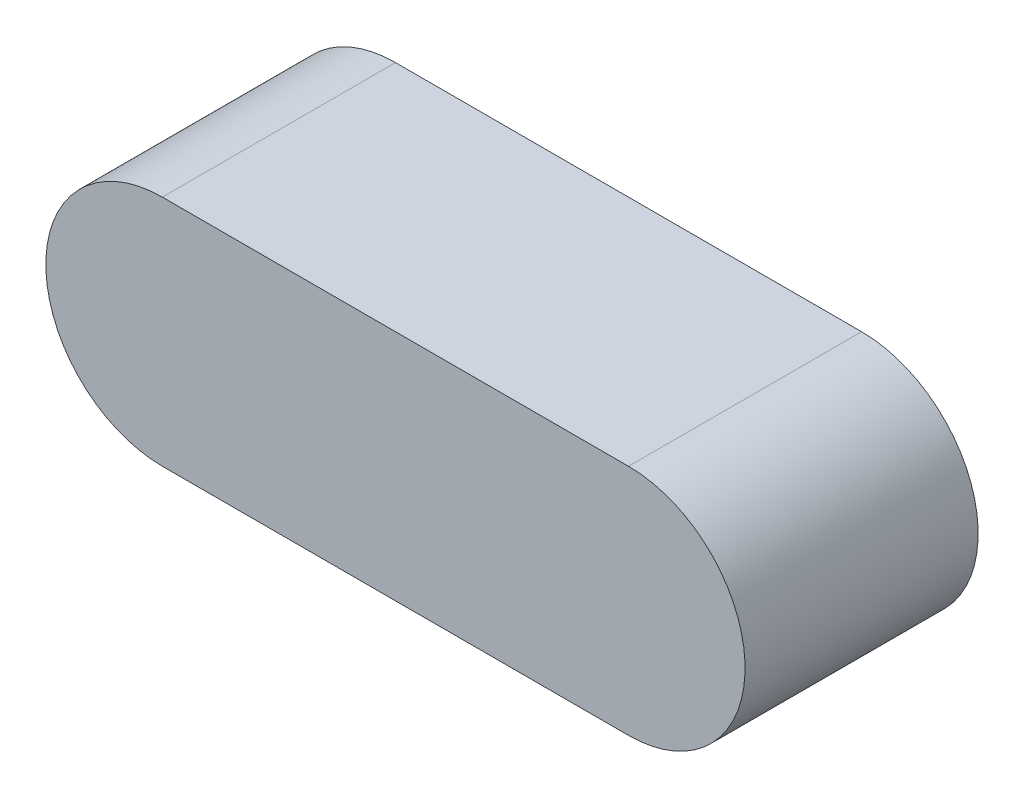
ISO-10303-21;
HEADER;
FILE_DESCRIPTION(('STEP AP214'),'2;1');
FILE_NAME('part.step','',(''),(''),'','','');
FILE_SCHEMA(('AUTOMOTIVE_DESIGN { 1 0 10303 214 1 1 1 1 }'));
ENDSEC;
DATA;
#1=APPLICATION_CONTEXT('core data for automotive mechanical design processes');
#2=APPLICATION_PROTOCOL_DEFINITION('international standard','automotive_design',2000,#1);
#3=PRODUCT_CONTEXT('',#1,'mechanical');
#4=PRODUCT('Part','Part','',(#3));
#5=PRODUCT_RELATED_PRODUCT_CATEGORY('part','',(#4));
#6=PRODUCT_DEFINITION_FORMATION('','',#4);
#7=PRODUCT_DEFINITION_CONTEXT('part definition',#1,'design');
#8=PRODUCT_DEFINITION('design','',#6,#7);
#9=PRODUCT_DEFINITION_SHAPE('','',#8);
#10=(LENGTH_UNIT() NAMED_UNIT(*) SI_UNIT(.MILLI.,.METRE.));
#11=(NAMED_UNIT(*) PLANE_ANGLE_UNIT() SI_UNIT($,.RADIAN.));
#12=(NAMED_UNIT(*) SI_UNIT($,.STERADIAN.) SOLID_ANGLE_UNIT());
#13=UNCERTAINTY_MEASURE_WITH_UNIT(LENGTH_MEASURE(1.E-05),#10,'distance_accuracy_value','');
#14=(GEOMETRIC_REPRESENTATION_CONTEXT(3) GLOBAL_UNCERTAINTY_ASSIGNED_CONTEXT((#13)) GLOBAL_UNIT_ASSIGNED_CONTEXT((#10,
#11,#12)) REPRESENTATION_CONTEXT('',''));
#15=CARTESIAN_POINT('',(0.,0.,0.));
#16=DIRECTION('',(0.,0.,1.));
#17=DIRECTION('',(1.,0.,0.));
#18=AXIS2_PLACEMENT_3D('',#15,#16,#17);
#19=CARTESIAN_POINT('',(-3.,0.,3.));
#20=DIRECTION('',(0.,0.,-1.));
#21=DIRECTION('',(-1.,0.,0.));
#22=AXIS2_PLACEMENT_3D('',#19,#20,#21);
#23=CYLINDRICAL_SURFACE('',#22,1.5);
#24=CARTESIAN_POINT('',(-3.,0.,0.));
#25=DIRECTION('',(0.,0.,1.));
#26=DIRECTION('',(1.,0.,0.));
#27=AXIS2_PLACEMENT_3D('',#24,#25,#26);
#28=CIRCLE('',#27,1.5);
#29=CARTESIAN_POINT('',(-3.,1.5,0.));
#30=VERTEX_POINT('',#29);
#31=CARTESIAN_POINT('',(-3.,-1.5,0.));
#32=VERTEX_POINT('',#31);
#33=EDGE_CURVE('E80',#30,#32,#28,.T.);
#34=ORIENTED_EDGE('',*,*,#33,.T.);
#35=DIRECTION('',(0.,0.,-1.));
#36=VECTOR('',#35,1.);
#37=CARTESIAN_POINT('',(-3.,-1.5,3.));
#38=LINE('',#37,#36);
#39=CARTESIAN_POINT('',(-3.,-1.5,3.));
#40=VERTEX_POINT('',#39);
#41=EDGE_CURVE('E13',#40,#32,#38,.T.);
#42=ORIENTED_EDGE('',*,*,#41,.F.);
#43=CARTESIAN_POINT('',(-3.,0.,3.));
#44=DIRECTION('',(0.,0.,1.));
#45=DIRECTION('',(1.,0.,0.));
#46=AXIS2_PLACEMENT_3D('',#43,#44,#45);
#47=CIRCLE('',#46,1.5);
#48=CARTESIAN_POINT('',(-3.,1.5,3.));
#49=VERTEX_POINT('',#48);
#50=EDGE_CURVE('E98',#49,#40,#47,.T.);
#51=ORIENTED_EDGE('',*,*,#50,.F.);
#52=DIRECTION('',(0.,0.,-1.));
#53=VECTOR('',#52,1.);
#54=CARTESIAN_POINT('',(-3.,1.5,3.));
#55=LINE('',#54,#53);
#56=EDGE_CURVE('E92',#49,#30,#55,.T.);
#57=ORIENTED_EDGE('',*,*,#56,.T.);
#58=EDGE_LOOP('',(#34,#42,#51,#57));
#59=FACE_BOUND('',#58,.T.);
#60=ADVANCED_FACE('F36',(#59),#23,.T.);
#61=CARTESIAN_POINT('',(-3.,-1.5,3.));
#62=DIRECTION('',(0.,1.,0.));
#63=DIRECTION('',(-1.,0.,0.));
#64=AXIS2_PLACEMENT_3D('',#61,#62,#63);
#65=PLANE('',#64);
#66=DIRECTION('',(1.,0.,0.));
#67=VECTOR('',#66,1.);
#68=CARTESIAN_POINT('',(-3.,-1.5,0.));
#69=LINE('',#68,#67);
#70=CARTESIAN_POINT('',(3.,-1.5,0.));
#71=VERTEX_POINT('',#70);
#72=EDGE_CURVE('E76',#32,#71,#69,.T.);
#73=ORIENTED_EDGE('',*,*,#72,.T.);
#74=DIRECTION('',(0.,0.,-1.));
#75=VECTOR('',#74,1.);
#76=CARTESIAN_POINT('',(3.,-1.5,3.));
#77=LINE('',#76,#75);
#78=CARTESIAN_POINT('',(3.,-1.5,3.));
#79=VERTEX_POINT('',#78);
#80=EDGE_CURVE('E43',#79,#71,#77,.T.);
#81=ORIENTED_EDGE('',*,*,#80,.F.);
#82=DIRECTION('',(1.,0.,0.));
#83=VECTOR('',#82,1.);
#84=CARTESIAN_POINT('',(-3.,-1.5,3.));
#85=LINE('',#84,#83);
#86=EDGE_CURVE('E88',#40,#79,#85,.T.);
#87=ORIENTED_EDGE('',*,*,#86,.F.);
#88=ORIENTED_EDGE('',*,*,#41,.T.);
#89=EDGE_LOOP('',(#73,#81,#87,#88));
#90=FACE_BOUND('',#89,.T.);
#91=ADVANCED_FACE('F87',(#90),#65,.F.);
#92=CARTESIAN_POINT('',(3.,0.,3.));
#93=DIRECTION('',(0.,0.,-1.));
#94=DIRECTION('',(-1.,0.,0.));
#95=AXIS2_PLACEMENT_3D('',#92,#93,#94);
#96=CYLINDRICAL_SURFACE('',#95,1.5);
#97=CARTESIAN_POINT('',(3.,0.,0.));
#98=DIRECTION('',(0.,0.,1.));
#99=DIRECTION('',(1.,0.,0.));
#100=AXIS2_PLACEMENT_3D('',#97,#98,#99);
#101=CIRCLE('',#100,1.5);
#102=CARTESIAN_POINT('',(3.00000000000006,1.5,0.));
#103=VERTEX_POINT('',#102);
#104=EDGE_CURVE('E81',#71,#103,#101,.T.);
#105=ORIENTED_EDGE('',*,*,#104,.T.);
#106=DIRECTION('',(0.,0.,-1.));
#107=VECTOR('',#106,1.);
#108=CARTESIAN_POINT('',(3.00000000000006,1.5,3.));
#109=LINE('',#108,#107);
#110=CARTESIAN_POINT('',(3.00000000000006,1.5,3.));
#111=VERTEX_POINT('',#110);
#112=EDGE_CURVE('E104',#111,#103,#109,.T.);
#113=ORIENTED_EDGE('',*,*,#112,.F.);
#114=CARTESIAN_POINT('',(3.,0.,3.));
#115=DIRECTION('',(0.,0.,1.));
#116=DIRECTION('',(1.,0.,0.));
#117=AXIS2_PLACEMENT_3D('',#114,#115,#116);
#118=CIRCLE('',#117,1.5);
#119=EDGE_CURVE('E55',#79,#111,#118,.T.);
#120=ORIENTED_EDGE('',*,*,#119,.F.);
#121=ORIENTED_EDGE('',*,*,#80,.T.);
#122=EDGE_LOOP('',(#105,#113,#120,#121));
#123=FACE_BOUND('',#122,.T.);
#124=ADVANCED_FACE('F107',(#123),#96,.T.);
#125=CARTESIAN_POINT('',(-3.,1.5,3.));
#126=DIRECTION('',(0.,-1.,0.));
#127=DIRECTION('',(1.,0.,0.));
#128=AXIS2_PLACEMENT_3D('',#125,#126,#127);
#129=PLANE('',#128);
#130=DIRECTION('',(-1.,0.,0.));
#131=VECTOR('',#130,1.);
#132=CARTESIAN_POINT('',(-3.,1.5,0.));
#133=LINE('',#132,#131);
#134=EDGE_CURVE('E96',#103,#30,#133,.T.);
#135=ORIENTED_EDGE('',*,*,#134,.T.);
#136=ORIENTED_EDGE('',*,*,#56,.F.);
#137=DIRECTION('',(-1.,0.,0.));
#138=VECTOR('',#137,1.);
#139=CARTESIAN_POINT('',(-3.,1.5,3.));
#140=LINE('',#139,#138);
#141=EDGE_CURVE('E50',#111,#49,#140,.T.);
#142=ORIENTED_EDGE('',*,*,#141,.F.);
#143=ORIENTED_EDGE('',*,*,#112,.T.);
#144=EDGE_LOOP('',(#135,#136,#142,#143));
#145=FACE_BOUND('',#144,.T.);
#146=ADVANCED_FACE('F109',(#145),#129,.F.);
#147=CARTESIAN_POINT('',(-3.,0.,3.));
#148=DIRECTION('',(0.,0.,1.));
#149=DIRECTION('',(1.,0.,0.));
#150=AXIS2_PLACEMENT_3D('',#147,#148,#149);
#151=PLANE('',#150);
#152=ORIENTED_EDGE('',*,*,#50,.T.);
#153=ORIENTED_EDGE('',*,*,#86,.T.);
#154=ORIENTED_EDGE('',*,*,#119,.T.);
#155=ORIENTED_EDGE('',*,*,#141,.T.);
#156=EDGE_LOOP('',(#152,#153,#154,#155));
#157=FACE_BOUND('',#156,.T.);
#158=ADVANCED_FACE('F110',(#157),#151,.T.);
#159=CARTESIAN_POINT('',(-3.,0.,0.));
#160=DIRECTION('',(0.,0.,1.));
#161=DIRECTION('',(1.,0.,0.));
#162=AXIS2_PLACEMENT_3D('',#159,#160,#161);
#163=PLANE('',#162);
#164=ORIENTED_EDGE('',*,*,#33,.F.);
#165=ORIENTED_EDGE('',*,*,#134,.F.);
#166=ORIENTED_EDGE('',*,*,#104,.F.);
#167=ORIENTED_EDGE('',*,*,#72,.F.);
#168=EDGE_LOOP('',(#164,#165,#166,#167));
#169=FACE_BOUND('',#168,.T.);
#170=ADVANCED_FACE('F77',(#169),#163,.F.);
#171=CLOSED_SHELL('',(#60,#91,#124,#146,#158,#170));
#172=MANIFOLD_SOLID_BREP('B2',#171);
#173=ADVANCED_BREP_SHAPE_REPRESENTATION('',(#18,#172),#14);
#174=SHAPE_DEFINITION_REPRESENTATION(#9,#173);
ENDSEC;
END-ISO-10303-21;
